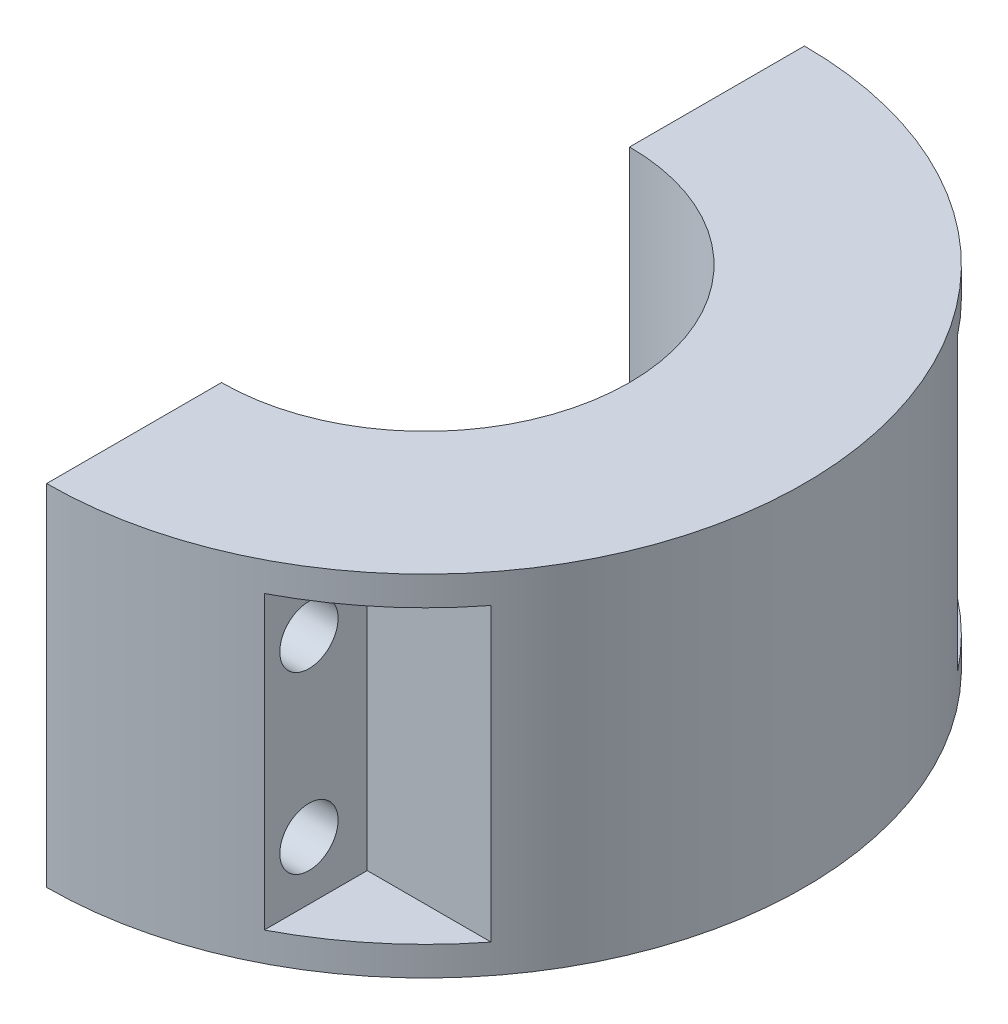
ISO-10303-21;
HEADER;
FILE_DESCRIPTION(('STEP AP214'),'2;1');
FILE_NAME('part.step','',(''),(''),'','','');
FILE_SCHEMA(('AUTOMOTIVE_DESIGN { 1 0 10303 214 1 1 1 1 }'));
ENDSEC;
DATA;
#1=APPLICATION_CONTEXT('core data for automotive mechanical design processes');
#2=APPLICATION_PROTOCOL_DEFINITION('international standard','automotive_design',2000,#1);
#3=PRODUCT_CONTEXT('',#1,'mechanical');
#4=PRODUCT('Part','Part','',(#3));
#5=PRODUCT_RELATED_PRODUCT_CATEGORY('part','',(#4));
#6=PRODUCT_DEFINITION_FORMATION('','',#4);
#7=PRODUCT_DEFINITION_CONTEXT('part definition',#1,'design');
#8=PRODUCT_DEFINITION('design','',#6,#7);
#9=PRODUCT_DEFINITION_SHAPE('','',#8);
#10=(LENGTH_UNIT() NAMED_UNIT(*) SI_UNIT(.MILLI.,.METRE.));
#11=(NAMED_UNIT(*) PLANE_ANGLE_UNIT() SI_UNIT($,.RADIAN.));
#12=(NAMED_UNIT(*) SI_UNIT($,.STERADIAN.) SOLID_ANGLE_UNIT());
#13=UNCERTAINTY_MEASURE_WITH_UNIT(LENGTH_MEASURE(1.E-05),#10,'distance_accuracy_value','');
#14=(GEOMETRIC_REPRESENTATION_CONTEXT(3) GLOBAL_UNCERTAINTY_ASSIGNED_CONTEXT((#13)) GLOBAL_UNIT_ASSIGNED_CONTEXT((#10,
#11,#12)) REPRESENTATION_CONTEXT('',''));
#15=CARTESIAN_POINT('',(0.,0.,0.));
#16=DIRECTION('',(0.,0.,1.));
#17=DIRECTION('',(1.,0.,0.));
#18=AXIS2_PLACEMENT_3D('',#15,#16,#17);
#19=CARTESIAN_POINT('',(82.55,57.15,-63.5));
#20=DIRECTION('',(-1.,0.,0.));
#21=DIRECTION('',(0.,0.,1.));
#22=AXIS2_PLACEMENT_3D('',#19,#20,#21);
#23=CYLINDRICAL_SURFACE('',#22,6.35);
#24=CARTESIAN_POINT('',(0.,57.15,-63.5));
#25=DIRECTION('',(-1.,0.,0.));
#26=DIRECTION('',(0.,0.,1.));
#27=AXIS2_PLACEMENT_3D('',#24,#25,#26);
#28=CIRCLE('',#27,6.35);
#29=CARTESIAN_POINT('',(0.,57.15,-57.15));
#30=VERTEX_POINT('',#29);
#31=EDGE_CURVE('E163',#30,#30,#28,.T.);
#32=ORIENTED_EDGE('',*,*,#31,.T.);
#33=EDGE_LOOP('',(#32));
#34=FACE_BOUND('',#33,.T.);
#35=CARTESIAN_POINT('',(38.1,57.15,-63.5));
#36=DIRECTION('',(1.,0.,0.));
#37=DIRECTION('',(0.,0.,-1.));
#38=AXIS2_PLACEMENT_3D('',#35,#36,#37);
#39=CIRCLE('',#38,6.35);
#40=CARTESIAN_POINT('',(38.1,57.15,-69.85));
#41=VERTEX_POINT('',#40);
#42=EDGE_CURVE('E154',#41,#41,#39,.F.);
#43=ORIENTED_EDGE('',*,*,#42,.F.);
#44=EDGE_LOOP('',(#43));
#45=FACE_BOUND('',#44,.T.);
#46=ADVANCED_FACE('F37',(#34,#45),#23,.F.);
#47=CARTESIAN_POINT('',(82.55,19.05,-63.5));
#48=DIRECTION('',(-1.,0.,0.));
#49=DIRECTION('',(0.,0.,1.));
#50=AXIS2_PLACEMENT_3D('',#47,#48,#49);
#51=CYLINDRICAL_SURFACE('',#50,6.35);
#52=CARTESIAN_POINT('',(0.,19.05,-63.5));
#53=DIRECTION('',(-1.,0.,0.));
#54=DIRECTION('',(0.,0.,1.));
#55=AXIS2_PLACEMENT_3D('',#52,#53,#54);
#56=CIRCLE('',#55,6.35);
#57=CARTESIAN_POINT('',(0.,19.05,-57.15));
#58=VERTEX_POINT('',#57);
#59=EDGE_CURVE('E160',#58,#58,#56,.T.);
#60=ORIENTED_EDGE('',*,*,#59,.T.);
#61=EDGE_LOOP('',(#60));
#62=FACE_BOUND('',#61,.T.);
#63=CARTESIAN_POINT('',(38.1,19.05,-63.5));
#64=DIRECTION('',(1.,0.,0.));
#65=DIRECTION('',(0.,0.,-1.));
#66=AXIS2_PLACEMENT_3D('',#63,#64,#65);
#67=CIRCLE('',#66,6.35);
#68=CARTESIAN_POINT('',(38.1,19.05,-69.85));
#69=VERTEX_POINT('',#68);
#70=EDGE_CURVE('E153',#69,#69,#67,.F.);
#71=ORIENTED_EDGE('',*,*,#70,.F.);
#72=EDGE_LOOP('',(#71));
#73=FACE_BOUND('',#72,.T.);
#74=ADVANCED_FACE('F231',(#62,#73),#51,.F.);
#75=CARTESIAN_POINT('',(82.55,19.05,63.5));
#76=DIRECTION('',(-1.,0.,0.));
#77=DIRECTION('',(0.,0.,1.));
#78=AXIS2_PLACEMENT_3D('',#75,#76,#77);
#79=CYLINDRICAL_SURFACE('',#78,6.35);
#80=CARTESIAN_POINT('',(0.,19.05,63.5));
#81=DIRECTION('',(-1.,0.,0.));
#82=DIRECTION('',(0.,0.,1.));
#83=AXIS2_PLACEMENT_3D('',#80,#81,#82);
#84=CIRCLE('',#83,6.35);
#85=CARTESIAN_POINT('',(0.,19.05,69.85));
#86=VERTEX_POINT('',#85);
#87=EDGE_CURVE('E164',#86,#86,#84,.T.);
#88=ORIENTED_EDGE('',*,*,#87,.T.);
#89=EDGE_LOOP('',(#88));
#90=FACE_BOUND('',#89,.T.);
#91=CARTESIAN_POINT('',(38.1,19.05,63.5));
#92=DIRECTION('',(1.,0.,0.));
#93=DIRECTION('',(0.,0.,-1.));
#94=AXIS2_PLACEMENT_3D('',#91,#92,#93);
#95=CIRCLE('',#94,6.35);
#96=CARTESIAN_POINT('',(38.1,19.05,57.15));
#97=VERTEX_POINT('',#96);
#98=EDGE_CURVE('E149',#97,#97,#95,.F.);
#99=ORIENTED_EDGE('',*,*,#98,.F.);
#100=EDGE_LOOP('',(#99));
#101=FACE_BOUND('',#100,.T.);
#102=ADVANCED_FACE('F237',(#90,#101),#79,.F.);
#103=CARTESIAN_POINT('',(82.55,57.15,63.5));
#104=DIRECTION('',(-1.,0.,0.));
#105=DIRECTION('',(0.,0.,1.));
#106=AXIS2_PLACEMENT_3D('',#103,#104,#105);
#107=CYLINDRICAL_SURFACE('',#106,6.35);
#108=CARTESIAN_POINT('',(0.,57.15,63.5));
#109=DIRECTION('',(-1.,0.,0.));
#110=DIRECTION('',(0.,0.,1.));
#111=AXIS2_PLACEMENT_3D('',#108,#109,#110);
#112=CIRCLE('',#111,6.35);
#113=CARTESIAN_POINT('',(0.,57.15,69.85));
#114=VERTEX_POINT('',#113);
#115=EDGE_CURVE('E159',#114,#114,#112,.T.);
#116=ORIENTED_EDGE('',*,*,#115,.T.);
#117=EDGE_LOOP('',(#116));
#118=FACE_BOUND('',#117,.T.);
#119=CARTESIAN_POINT('',(38.1,57.15,63.5));
#120=DIRECTION('',(1.,0.,0.));
#121=DIRECTION('',(0.,0.,-1.));
#122=AXIS2_PLACEMENT_3D('',#119,#120,#121);
#123=CIRCLE('',#122,6.35);
#124=CARTESIAN_POINT('',(38.1,57.15,57.15));
#125=VERTEX_POINT('',#124);
#126=EDGE_CURVE('E139',#125,#125,#123,.F.);
#127=ORIENTED_EDGE('',*,*,#126,.F.);
#128=EDGE_LOOP('',(#127));
#129=FACE_BOUND('',#128,.T.);
#130=ADVANCED_FACE('F243',(#118,#129),#107,.F.);
#131=CARTESIAN_POINT('',(0.,76.2,0.));
#132=DIRECTION('',(0.,-1.,0.));
#133=DIRECTION('',(0.,0.,-1.));
#134=AXIS2_PLACEMENT_3D('',#131,#132,#133);
#135=CYLINDRICAL_SURFACE('',#134,44.45);
#136=CARTESIAN_POINT('',(0.,0.,0.));
#137=DIRECTION('',(0.,-1.,0.));
#138=DIRECTION('',(0.,0.,1.));
#139=AXIS2_PLACEMENT_3D('',#136,#137,#138);
#140=CIRCLE('',#139,44.45);
#141=CARTESIAN_POINT('',(0.,0.,-44.45));
#142=VERTEX_POINT('',#141);
#143=CARTESIAN_POINT('',(0.,0.,44.45));
#144=VERTEX_POINT('',#143);
#145=EDGE_CURVE('E171',#142,#144,#140,.T.);
#146=ORIENTED_EDGE('',*,*,#145,.T.);
#147=DIRECTION('',(0.,-1.,0.));
#148=VECTOR('',#147,1.);
#149=CARTESIAN_POINT('',(0.,76.2,44.45));
#150=LINE('',#149,#148);
#151=CARTESIAN_POINT('',(0.,76.2,44.45));
#152=VERTEX_POINT('',#151);
#153=EDGE_CURVE('E198',#152,#144,#150,.T.);
#154=ORIENTED_EDGE('',*,*,#153,.F.);
#155=CARTESIAN_POINT('',(0.,76.2,0.));
#156=DIRECTION('',(0.,-1.,0.));
#157=DIRECTION('',(0.,0.,1.));
#158=AXIS2_PLACEMENT_3D('',#155,#156,#157);
#159=CIRCLE('',#158,44.45);
#160=CARTESIAN_POINT('',(0.,76.2,-44.45));
#161=VERTEX_POINT('',#160);
#162=EDGE_CURVE('E172',#161,#152,#159,.T.);
#163=ORIENTED_EDGE('',*,*,#162,.F.);
#164=DIRECTION('',(0.,-1.,0.));
#165=VECTOR('',#164,1.);
#166=CARTESIAN_POINT('',(0.,76.2,-44.45));
#167=LINE('',#166,#165);
#168=EDGE_CURVE('E182',#161,#142,#167,.T.);
#169=ORIENTED_EDGE('',*,*,#168,.T.);
#170=EDGE_LOOP('',(#146,#154,#163,#169));
#171=FACE_BOUND('',#170,.T.);
#172=ADVANCED_FACE('F39',(#171),#135,.F.);
#173=CARTESIAN_POINT('',(0.,76.2,44.45));
#174=DIRECTION('',(1.,0.,0.));
#175=DIRECTION('',(0.,0.,-1.));
#176=AXIS2_PLACEMENT_3D('',#173,#174,#175);
#177=PLANE('',#176);
#178=ORIENTED_EDGE('',*,*,#115,.F.);
#179=EDGE_LOOP('',(#178));
#180=FACE_BOUND('',#179,.T.);
#181=ORIENTED_EDGE('',*,*,#87,.F.);
#182=EDGE_LOOP('',(#181));
#183=FACE_BOUND('',#182,.T.);
#184=DIRECTION('',(0.,0.,1.));
#185=VECTOR('',#184,1.);
#186=CARTESIAN_POINT('',(0.,0.,44.45));
#187=LINE('',#186,#185);
#188=CARTESIAN_POINT('',(0.,0.,82.55));
#189=VERTEX_POINT('',#188);
#190=EDGE_CURVE('E185',#144,#189,#187,.T.);
#191=ORIENTED_EDGE('',*,*,#190,.T.);
#192=DIRECTION('',(0.,-1.,0.));
#193=VECTOR('',#192,1.);
#194=CARTESIAN_POINT('',(0.,76.2,82.55));
#195=LINE('',#194,#193);
#196=CARTESIAN_POINT('',(0.,76.2,82.55));
#197=VERTEX_POINT('',#196);
#198=EDGE_CURVE('E195',#197,#189,#195,.T.);
#199=ORIENTED_EDGE('',*,*,#198,.F.);
#200=DIRECTION('',(0.,0.,1.));
#201=VECTOR('',#200,1.);
#202=CARTESIAN_POINT('',(0.,76.2,44.45));
#203=LINE('',#202,#201);
#204=EDGE_CURVE('E175',#152,#197,#203,.T.);
#205=ORIENTED_EDGE('',*,*,#204,.F.);
#206=ORIENTED_EDGE('',*,*,#153,.T.);
#207=EDGE_LOOP('',(#191,#199,#205,#206));
#208=FACE_BOUND('',#207,.T.);
#209=ADVANCED_FACE('F257',(#180,#183,#208),#177,.F.);
#210=CARTESIAN_POINT('',(0.,76.2,0.));
#211=DIRECTION('',(0.,-1.,0.));
#212=DIRECTION('',(0.,0.,-1.));
#213=AXIS2_PLACEMENT_3D('',#210,#211,#212);
#214=CYLINDRICAL_SURFACE('',#213,82.55);
#215=CARTESIAN_POINT('',(0.,69.85,0.));
#216=DIRECTION('',(0.,1.,0.));
#217=DIRECTION('',(0.,0.,1.));
#218=AXIS2_PLACEMENT_3D('',#215,#216,#217);
#219=CIRCLE('',#218,82.55);
#220=CARTESIAN_POINT('',(38.1,69.85,73.2317724761595));
#221=VERTEX_POINT('',#220);
#222=CARTESIAN_POINT('',(65.0681373638434,69.85,50.8));
#223=VERTEX_POINT('',#222);
#224=EDGE_CURVE('E45',#221,#223,#219,.T.);
#225=ORIENTED_EDGE('',*,*,#224,.T.);
#226=DIRECTION('',(0.,-1.,0.));
#227=VECTOR('',#226,1.);
#228=CARTESIAN_POINT('',(65.0681373638434,76.2,50.8));
#229=LINE('',#228,#227);
#230=CARTESIAN_POINT('',(65.0681373638434,6.35000000000001,50.8));
#231=VERTEX_POINT('',#230);
#232=EDGE_CURVE('E11',#223,#231,#229,.T.);
#233=ORIENTED_EDGE('',*,*,#232,.T.);
#234=CARTESIAN_POINT('',(0.,6.35000000000001,0.));
#235=DIRECTION('',(0.,-1.,0.));
#236=DIRECTION('',(0.,0.,-1.));
#237=AXIS2_PLACEMENT_3D('',#234,#235,#236);
#238=CIRCLE('',#237,82.55);
#239=CARTESIAN_POINT('',(38.1,6.35000000000001,73.2317724761595));
#240=VERTEX_POINT('',#239);
#241=EDGE_CURVE('E121',#231,#240,#238,.T.);
#242=ORIENTED_EDGE('',*,*,#241,.T.);
#243=DIRECTION('',(0.,-1.,0.));
#244=VECTOR('',#243,1.);
#245=CARTESIAN_POINT('',(38.1,76.2,73.2317724761595));
#246=LINE('',#245,#244);
#247=EDGE_CURVE('E129',#221,#240,#246,.T.);
#248=ORIENTED_EDGE('',*,*,#247,.F.);
#249=EDGE_LOOP('',(#225,#233,#242,#248));
#250=FACE_BOUND('',#249,.T.);
#251=DIRECTION('',(0.,-1.,0.));
#252=VECTOR('',#251,1.);
#253=CARTESIAN_POINT('',(65.0681373638434,76.2,-50.8));
#254=LINE('',#253,#252);
#255=CARTESIAN_POINT('',(65.0681373638434,6.34999999999999,-50.8));
#256=VERTEX_POINT('',#255);
#257=CARTESIAN_POINT('',(65.0681373638434,69.85,-50.8));
#258=VERTEX_POINT('',#257);
#259=EDGE_CURVE('E208',#256,#258,#254,.F.);
#260=ORIENTED_EDGE('',*,*,#259,.T.);
#261=CARTESIAN_POINT('',(0.,69.85,0.));
#262=DIRECTION('',(0.,1.,0.));
#263=DIRECTION('',(0.,0.,1.));
#264=AXIS2_PLACEMENT_3D('',#261,#262,#263);
#265=CIRCLE('',#264,82.55);
#266=CARTESIAN_POINT('',(38.1,69.85,-73.2317724761595));
#267=VERTEX_POINT('',#266);
#268=EDGE_CURVE('E211',#258,#267,#265,.T.);
#269=ORIENTED_EDGE('',*,*,#268,.T.);
#270=DIRECTION('',(0.,-1.,0.));
#271=VECTOR('',#270,1.);
#272=CARTESIAN_POINT('',(38.1,76.2,-73.2317724761595));
#273=LINE('',#272,#271);
#274=CARTESIAN_POINT('',(38.1,6.34999999999999,-73.2317724761595));
#275=VERTEX_POINT('',#274);
#276=EDGE_CURVE('E157',#275,#267,#273,.F.);
#277=ORIENTED_EDGE('',*,*,#276,.F.);
#278=CARTESIAN_POINT('',(0.,6.34999999999999,0.));
#279=DIRECTION('',(0.,-1.,0.));
#280=DIRECTION('',(0.,0.,-1.));
#281=AXIS2_PLACEMENT_3D('',#278,#279,#280);
#282=CIRCLE('',#281,82.55);
#283=EDGE_CURVE('E201',#275,#256,#282,.T.);
#284=ORIENTED_EDGE('',*,*,#283,.T.);
#285=EDGE_LOOP('',(#260,#269,#277,#284));
#286=FACE_BOUND('',#285,.T.);
#287=CARTESIAN_POINT('',(0.,0.,0.));
#288=DIRECTION('',(0.,1.,0.));
#289=DIRECTION('',(0.,0.,1.));
#290=AXIS2_PLACEMENT_3D('',#287,#288,#289);
#291=CIRCLE('',#290,82.55);
#292=CARTESIAN_POINT('',(0.,0.,-82.55));
#293=VERTEX_POINT('',#292);
#294=EDGE_CURVE('E187',#189,#293,#291,.T.);
#295=ORIENTED_EDGE('',*,*,#294,.T.);
#296=DIRECTION('',(0.,-1.,0.));
#297=VECTOR('',#296,1.);
#298=CARTESIAN_POINT('',(0.,76.2,-82.55));
#299=LINE('',#298,#297);
#300=CARTESIAN_POINT('',(0.,76.2,-82.55));
#301=VERTEX_POINT('',#300);
#302=EDGE_CURVE('E192',#301,#293,#299,.T.);
#303=ORIENTED_EDGE('',*,*,#302,.F.);
#304=CARTESIAN_POINT('',(0.,76.2,0.));
#305=DIRECTION('',(0.,1.,0.));
#306=DIRECTION('',(0.,0.,1.));
#307=AXIS2_PLACEMENT_3D('',#304,#305,#306);
#308=CIRCLE('',#307,82.55);
#309=EDGE_CURVE('E178',#197,#301,#308,.T.);
#310=ORIENTED_EDGE('',*,*,#309,.F.);
#311=ORIENTED_EDGE('',*,*,#198,.T.);
#312=EDGE_LOOP('',(#295,#303,#310,#311));
#313=FACE_BOUND('',#312,.T.);
#314=ADVANCED_FACE('F216',(#250,#286,#313),#214,.T.);
#315=CARTESIAN_POINT('',(0.,76.2,-82.55));
#316=DIRECTION('',(1.,0.,0.));
#317=DIRECTION('',(0.,0.,-1.));
#318=AXIS2_PLACEMENT_3D('',#315,#316,#317);
#319=PLANE('',#318);
#320=ORIENTED_EDGE('',*,*,#59,.F.);
#321=EDGE_LOOP('',(#320));
#322=FACE_BOUND('',#321,.T.);
#323=ORIENTED_EDGE('',*,*,#31,.F.);
#324=EDGE_LOOP('',(#323));
#325=FACE_BOUND('',#324,.T.);
#326=DIRECTION('',(0.,0.,1.));
#327=VECTOR('',#326,1.);
#328=CARTESIAN_POINT('',(0.,0.,-82.55));
#329=LINE('',#328,#327);
#330=EDGE_CURVE('E176',#293,#142,#329,.T.);
#331=ORIENTED_EDGE('',*,*,#330,.T.);
#332=ORIENTED_EDGE('',*,*,#168,.F.);
#333=DIRECTION('',(0.,0.,1.));
#334=VECTOR('',#333,1.);
#335=CARTESIAN_POINT('',(0.,76.2,-82.55));
#336=LINE('',#335,#334);
#337=EDGE_CURVE('E180',#301,#161,#336,.T.);
#338=ORIENTED_EDGE('',*,*,#337,.F.);
#339=ORIENTED_EDGE('',*,*,#302,.T.);
#340=EDGE_LOOP('',(#331,#332,#338,#339));
#341=FACE_BOUND('',#340,.T.);
#342=ADVANCED_FACE('F248',(#322,#325,#341),#319,.F.);
#343=CARTESIAN_POINT('',(0.,76.2,0.));
#344=DIRECTION('',(0.,1.,0.));
#345=DIRECTION('',(0.,0.,1.));
#346=AXIS2_PLACEMENT_3D('',#343,#344,#345);
#347=PLANE('',#346);
#348=ORIENTED_EDGE('',*,*,#162,.T.);
#349=ORIENTED_EDGE('',*,*,#204,.T.);
#350=ORIENTED_EDGE('',*,*,#309,.T.);
#351=ORIENTED_EDGE('',*,*,#337,.T.);
#352=EDGE_LOOP('',(#348,#349,#350,#351));
#353=FACE_BOUND('',#352,.T.);
#354=ADVANCED_FACE('F245',(#353),#347,.T.);
#355=CARTESIAN_POINT('',(0.,0.,0.));
#356=DIRECTION('',(0.,1.,0.));
#357=DIRECTION('',(0.,0.,1.));
#358=AXIS2_PLACEMENT_3D('',#355,#356,#357);
#359=PLANE('',#358);
#360=ORIENTED_EDGE('',*,*,#145,.F.);
#361=ORIENTED_EDGE('',*,*,#330,.F.);
#362=ORIENTED_EDGE('',*,*,#294,.F.);
#363=ORIENTED_EDGE('',*,*,#190,.F.);
#364=EDGE_LOOP('',(#360,#361,#362,#363));
#365=FACE_BOUND('',#364,.T.);
#366=ADVANCED_FACE('F227',(#365),#359,.F.);
#367=CARTESIAN_POINT('',(82.55,69.85,50.8));
#368=DIRECTION('',(0.,0.,-1.));
#369=DIRECTION('',(0.,1.,0.));
#370=AXIS2_PLACEMENT_3D('',#367,#368,#369);
#371=PLANE('',#370);
#372=DIRECTION('',(-1.,0.,0.));
#373=VECTOR('',#372,1.);
#374=CARTESIAN_POINT('',(82.55,69.85,50.8));
#375=LINE('',#374,#373);
#376=CARTESIAN_POINT('',(38.1,69.85,50.8));
#377=VERTEX_POINT('',#376);
#378=EDGE_CURVE('E124',#223,#377,#375,.T.);
#379=ORIENTED_EDGE('',*,*,#378,.T.);
#380=DIRECTION('',(0.,-1.,0.));
#381=VECTOR('',#380,1.);
#382=CARTESIAN_POINT('',(38.1,69.85,50.8));
#383=LINE('',#382,#381);
#384=CARTESIAN_POINT('',(38.1,6.35000000000001,50.8));
#385=VERTEX_POINT('',#384);
#386=EDGE_CURVE('E127',#377,#385,#383,.T.);
#387=ORIENTED_EDGE('',*,*,#386,.T.);
#388=DIRECTION('',(-1.,0.,0.));
#389=VECTOR('',#388,1.);
#390=CARTESIAN_POINT('',(82.55,6.35000000000001,50.8));
#391=LINE('',#390,#389);
#392=EDGE_CURVE('E116',#231,#385,#391,.T.);
#393=ORIENTED_EDGE('',*,*,#392,.F.);
#394=ORIENTED_EDGE('',*,*,#232,.F.);
#395=EDGE_LOOP('',(#379,#387,#393,#394));
#396=FACE_BOUND('',#395,.T.);
#397=ADVANCED_FACE('F131',(#396),#371,.F.);
#398=CARTESIAN_POINT('',(82.55,69.85,76.2));
#399=DIRECTION('',(0.,1.,0.));
#400=DIRECTION('',(0.,0.,1.));
#401=AXIS2_PLACEMENT_3D('',#398,#399,#400);
#402=PLANE('',#401);
#403=DIRECTION('',(0.,0.,-1.));
#404=VECTOR('',#403,1.);
#405=CARTESIAN_POINT('',(38.1,69.85,76.2));
#406=LINE('',#405,#404);
#407=EDGE_CURVE('E52',#221,#377,#406,.T.);
#408=ORIENTED_EDGE('',*,*,#407,.T.);
#409=ORIENTED_EDGE('',*,*,#378,.F.);
#410=ORIENTED_EDGE('',*,*,#224,.F.);
#411=EDGE_LOOP('',(#408,#409,#410));
#412=FACE_BOUND('',#411,.T.);
#413=ADVANCED_FACE('F219',(#412),#402,.F.);
#414=CARTESIAN_POINT('',(82.55,6.35000000000001,76.2));
#415=DIRECTION('',(0.,-1.,0.));
#416=DIRECTION('',(0.,0.,-1.));
#417=AXIS2_PLACEMENT_3D('',#414,#415,#416);
#418=PLANE('',#417);
#419=ORIENTED_EDGE('',*,*,#392,.T.);
#420=DIRECTION('',(0.,0.,1.));
#421=VECTOR('',#420,1.);
#422=CARTESIAN_POINT('',(38.1,6.35000000000001,76.2));
#423=LINE('',#422,#421);
#424=EDGE_CURVE('E119',#385,#240,#423,.T.);
#425=ORIENTED_EDGE('',*,*,#424,.T.);
#426=ORIENTED_EDGE('',*,*,#241,.F.);
#427=EDGE_LOOP('',(#419,#425,#426));
#428=FACE_BOUND('',#427,.T.);
#429=ADVANCED_FACE('F118',(#428),#418,.F.);
#430=CARTESIAN_POINT('',(38.1,0.,0.));
#431=DIRECTION('',(1.,0.,0.));
#432=DIRECTION('',(0.,0.,-1.));
#433=AXIS2_PLACEMENT_3D('',#430,#431,#432);
#434=PLANE('',#433);
#435=ORIENTED_EDGE('',*,*,#98,.T.);
#436=EDGE_LOOP('',(#435));
#437=FACE_BOUND('',#436,.T.);
#438=ORIENTED_EDGE('',*,*,#126,.T.);
#439=EDGE_LOOP('',(#438));
#440=FACE_BOUND('',#439,.T.);
#441=ORIENTED_EDGE('',*,*,#247,.T.);
#442=ORIENTED_EDGE('',*,*,#424,.F.);
#443=ORIENTED_EDGE('',*,*,#386,.F.);
#444=ORIENTED_EDGE('',*,*,#407,.F.);
#445=EDGE_LOOP('',(#441,#442,#443,#444));
#446=FACE_BOUND('',#445,.T.);
#447=ADVANCED_FACE('F126',(#437,#440,#446),#434,.T.);
#448=CARTESIAN_POINT('',(82.55,69.85,-50.8));
#449=DIRECTION('',(0.,1.,0.));
#450=DIRECTION('',(0.,0.,1.));
#451=AXIS2_PLACEMENT_3D('',#448,#449,#450);
#452=PLANE('',#451);
#453=DIRECTION('',(-1.,0.,0.));
#454=VECTOR('',#453,1.);
#455=CARTESIAN_POINT('',(82.55,69.85,-50.8));
#456=LINE('',#455,#454);
#457=CARTESIAN_POINT('',(38.1,69.85,-50.8));
#458=VERTEX_POINT('',#457);
#459=EDGE_CURVE('E133',#258,#458,#456,.T.);
#460=ORIENTED_EDGE('',*,*,#459,.T.);
#461=DIRECTION('',(0.,0.,-1.));
#462=VECTOR('',#461,1.);
#463=CARTESIAN_POINT('',(38.1,69.85,-50.8));
#464=LINE('',#463,#462);
#465=EDGE_CURVE('E145',#458,#267,#464,.T.);
#466=ORIENTED_EDGE('',*,*,#465,.T.);
#467=ORIENTED_EDGE('',*,*,#268,.F.);
#468=EDGE_LOOP('',(#460,#466,#467));
#469=FACE_BOUND('',#468,.T.);
#470=ADVANCED_FACE('F287',(#469),#452,.F.);
#471=CARTESIAN_POINT('',(82.55,69.85,-50.8));
#472=DIRECTION('',(0.,0.,1.));
#473=DIRECTION('',(0.,-1.,0.));
#474=AXIS2_PLACEMENT_3D('',#471,#472,#473);
#475=PLANE('',#474);
#476=DIRECTION('',(-1.,0.,0.));
#477=VECTOR('',#476,1.);
#478=CARTESIAN_POINT('',(82.55,6.34999999999999,-50.8));
#479=LINE('',#478,#477);
#480=CARTESIAN_POINT('',(38.1,6.34999999999999,-50.8));
#481=VERTEX_POINT('',#480);
#482=EDGE_CURVE('E135',#256,#481,#479,.T.);
#483=ORIENTED_EDGE('',*,*,#482,.T.);
#484=DIRECTION('',(0.,1.,0.));
#485=VECTOR('',#484,1.);
#486=CARTESIAN_POINT('',(38.1,69.85,-50.8));
#487=LINE('',#486,#485);
#488=EDGE_CURVE('E142',#481,#458,#487,.T.);
#489=ORIENTED_EDGE('',*,*,#488,.T.);
#490=ORIENTED_EDGE('',*,*,#459,.F.);
#491=ORIENTED_EDGE('',*,*,#259,.F.);
#492=EDGE_LOOP('',(#483,#489,#490,#491));
#493=FACE_BOUND('',#492,.T.);
#494=ADVANCED_FACE('F369',(#493),#475,.F.);
#495=CARTESIAN_POINT('',(82.55,6.34999999999999,-50.8));
#496=DIRECTION('',(0.,-1.,0.));
#497=DIRECTION('',(0.,0.,-1.));
#498=AXIS2_PLACEMENT_3D('',#495,#496,#497);
#499=PLANE('',#498);
#500=DIRECTION('',(0.,0.,1.));
#501=VECTOR('',#500,1.);
#502=CARTESIAN_POINT('',(38.1,6.34999999999999,-50.8));
#503=LINE('',#502,#501);
#504=EDGE_CURVE('E60',#275,#481,#503,.T.);
#505=ORIENTED_EDGE('',*,*,#504,.T.);
#506=ORIENTED_EDGE('',*,*,#482,.F.);
#507=ORIENTED_EDGE('',*,*,#283,.F.);
#508=EDGE_LOOP('',(#505,#506,#507));
#509=FACE_BOUND('',#508,.T.);
#510=ADVANCED_FACE('F378',(#509),#499,.F.);
#511=CARTESIAN_POINT('',(38.1,0.,0.));
#512=DIRECTION('',(1.,0.,0.));
#513=DIRECTION('',(0.,0.,-1.));
#514=AXIS2_PLACEMENT_3D('',#511,#512,#513);
#515=PLANE('',#514);
#516=ORIENTED_EDGE('',*,*,#42,.T.);
#517=EDGE_LOOP('',(#516));
#518=FACE_BOUND('',#517,.T.);
#519=ORIENTED_EDGE('',*,*,#70,.T.);
#520=EDGE_LOOP('',(#519));
#521=FACE_BOUND('',#520,.T.);
#522=ORIENTED_EDGE('',*,*,#276,.T.);
#523=ORIENTED_EDGE('',*,*,#465,.F.);
#524=ORIENTED_EDGE('',*,*,#488,.F.);
#525=ORIENTED_EDGE('',*,*,#504,.F.);
#526=EDGE_LOOP('',(#522,#523,#524,#525));
#527=FACE_BOUND('',#526,.T.);
#528=ADVANCED_FACE('F387',(#518,#521,#527),#515,.T.);
#529=CLOSED_SHELL('',(#46,#74,#102,#130,#172,#209,#314,#342,#354,#366,#397,#413,#429,#447,#470,
#494,#510,#528));
#530=MANIFOLD_SOLID_BREP('B2',#529);
#531=ADVANCED_BREP_SHAPE_REPRESENTATION('',(#18,#530),#14);
#532=SHAPE_DEFINITION_REPRESENTATION(#9,#531);
ENDSEC;
END-ISO-10303-21;
